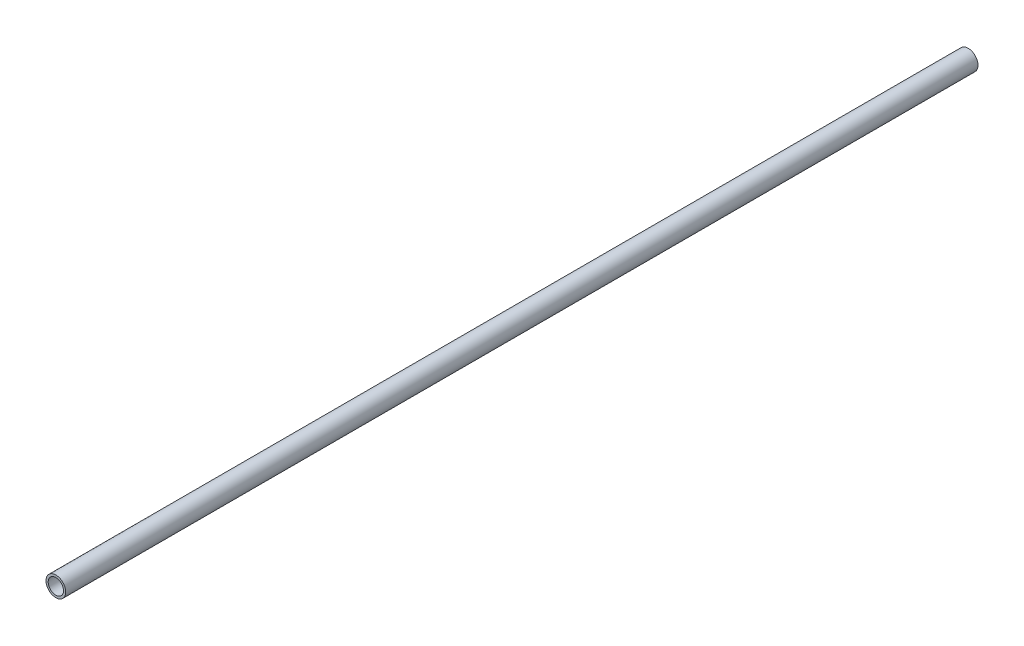
ISO-10303-21;
HEADER;
FILE_DESCRIPTION(('STEP AP214'),'2;1');
FILE_NAME('part.step','',(''),(''),'','','');
FILE_SCHEMA(('AUTOMOTIVE_DESIGN { 1 0 10303 214 1 1 1 1 }'));
ENDSEC;
DATA;
#1=APPLICATION_CONTEXT('core data for automotive mechanical design processes');
#2=APPLICATION_PROTOCOL_DEFINITION('international standard','automotive_design',2000,#1);
#3=PRODUCT_CONTEXT('',#1,'mechanical');
#4=PRODUCT('Part','Part','',(#3));
#5=PRODUCT_RELATED_PRODUCT_CATEGORY('part','',(#4));
#6=PRODUCT_DEFINITION_FORMATION('','',#4);
#7=PRODUCT_DEFINITION_CONTEXT('part definition',#1,'design');
#8=PRODUCT_DEFINITION('design','',#6,#7);
#9=PRODUCT_DEFINITION_SHAPE('','',#8);
#10=(LENGTH_UNIT() NAMED_UNIT(*) SI_UNIT(.MILLI.,.METRE.));
#11=(NAMED_UNIT(*) PLANE_ANGLE_UNIT() SI_UNIT($,.RADIAN.));
#12=(NAMED_UNIT(*) SI_UNIT($,.STERADIAN.) SOLID_ANGLE_UNIT());
#13=UNCERTAINTY_MEASURE_WITH_UNIT(LENGTH_MEASURE(1.E-05),#10,'distance_accuracy_value','');
#14=(GEOMETRIC_REPRESENTATION_CONTEXT(3) GLOBAL_UNCERTAINTY_ASSIGNED_CONTEXT((#13)) GLOBAL_UNIT_ASSIGNED_CONTEXT((#10,
#11,#12)) REPRESENTATION_CONTEXT('',''));
#15=CARTESIAN_POINT('',(0.,0.,0.));
#16=DIRECTION('',(0.,0.,1.));
#17=DIRECTION('',(1.,0.,0.));
#18=AXIS2_PLACEMENT_3D('',#15,#16,#17);
#19=CARTESIAN_POINT('',(-7.31916779058315,4.99702218634191,1270.));
#20=DIRECTION('',(0.,0.,-1.));
#21=DIRECTION('',(-1.,0.,0.));
#22=AXIS2_PLACEMENT_3D('',#19,#20,#21);
#23=CYLINDRICAL_SURFACE('',#22,13.716);
#24=CARTESIAN_POINT('',(-7.31916779058315,4.99702218634191,1270.));
#25=DIRECTION('',(0.,0.,1.));
#26=DIRECTION('',(1.,0.,0.));
#27=AXIS2_PLACEMENT_3D('',#24,#25,#26);
#28=CIRCLE('',#27,13.716);
#29=CARTESIAN_POINT('',(6.39683220941685,4.99702218634191,1270.));
#30=VERTEX_POINT('',#29);
#31=EDGE_CURVE('E10',#30,#30,#28,.T.);
#32=ORIENTED_EDGE('',*,*,#31,.F.);
#33=EDGE_LOOP('',(#32));
#34=FACE_BOUND('',#33,.T.);
#35=CARTESIAN_POINT('',(-7.31916779058315,4.99702218634191,0.));
#36=DIRECTION('',(0.,0.,1.));
#37=DIRECTION('',(1.,0.,0.));
#38=AXIS2_PLACEMENT_3D('',#35,#36,#37);
#39=CIRCLE('',#38,13.716);
#40=CARTESIAN_POINT('',(6.39683220941685,4.99702218634191,0.));
#41=VERTEX_POINT('',#40);
#42=EDGE_CURVE('E38',#41,#41,#39,.T.);
#43=ORIENTED_EDGE('',*,*,#42,.T.);
#44=EDGE_LOOP('',(#43));
#45=FACE_BOUND('',#44,.T.);
#46=ADVANCED_FACE('F35',(#34,#45),#23,.T.);
#47=CARTESIAN_POINT('',(-7.31916779058315,4.99702218634191,1270.));
#48=DIRECTION('',(0.,0.,1.));
#49=DIRECTION('',(1.,0.,0.));
#50=AXIS2_PLACEMENT_3D('',#47,#48,#49);
#51=PLANE('',#50);
#52=CARTESIAN_POINT('',(-7.31916779058315,4.99702218634191,1270.));
#53=DIRECTION('',(0.,0.,-1.));
#54=DIRECTION('',(-1.,0.,0.));
#55=AXIS2_PLACEMENT_3D('',#52,#53,#54);
#56=CIRCLE('',#55,10.668);
#57=CARTESIAN_POINT('',(-17.9871677905831,4.99702218634191,1270.));
#58=VERTEX_POINT('',#57);
#59=EDGE_CURVE('E47',#58,#58,#56,.T.);
#60=ORIENTED_EDGE('',*,*,#59,.T.);
#61=EDGE_LOOP('',(#60));
#62=FACE_BOUND('',#61,.T.);
#63=ORIENTED_EDGE('',*,*,#31,.T.);
#64=EDGE_LOOP('',(#63));
#65=FACE_BOUND('',#64,.T.);
#66=ADVANCED_FACE('F57',(#62,#65),#51,.T.);
#67=CARTESIAN_POINT('',(-7.31916779058315,4.99702218634191,0.));
#68=DIRECTION('',(0.,0.,1.));
#69=DIRECTION('',(1.,0.,0.));
#70=AXIS2_PLACEMENT_3D('',#67,#68,#69);
#71=PLANE('',#70);
#72=CARTESIAN_POINT('',(-7.31916779058315,4.99702218634191,0.));
#73=DIRECTION('',(0.,0.,-1.));
#74=DIRECTION('',(-1.,0.,0.));
#75=AXIS2_PLACEMENT_3D('',#72,#73,#74);
#76=CIRCLE('',#75,10.668);
#77=CARTESIAN_POINT('',(-17.9871677905831,4.99702218634191,0.));
#78=VERTEX_POINT('',#77);
#79=EDGE_CURVE('E49',#78,#78,#76,.T.);
#80=ORIENTED_EDGE('',*,*,#79,.F.);
#81=EDGE_LOOP('',(#80));
#82=FACE_BOUND('',#81,.T.);
#83=ORIENTED_EDGE('',*,*,#42,.F.);
#84=EDGE_LOOP('',(#83));
#85=FACE_BOUND('',#84,.T.);
#86=ADVANCED_FACE('F62',(#82,#85),#71,.F.);
#87=CARTESIAN_POINT('',(-7.31916779058315,4.99702218634191,1270.));
#88=DIRECTION('',(0.,0.,-1.));
#89=DIRECTION('',(-1.,0.,0.));
#90=AXIS2_PLACEMENT_3D('',#87,#88,#89);
#91=CYLINDRICAL_SURFACE('',#90,10.668);
#92=ORIENTED_EDGE('',*,*,#59,.F.);
#93=EDGE_LOOP('',(#92));
#94=FACE_BOUND('',#93,.T.);
#95=ORIENTED_EDGE('',*,*,#79,.T.);
#96=EDGE_LOOP('',(#95));
#97=FACE_BOUND('',#96,.T.);
#98=ADVANCED_FACE('F59',(#94,#97),#91,.F.);
#99=CLOSED_SHELL('',(#46,#66,#86,#98));
#100=MANIFOLD_SOLID_BREP('B2',#99);
#101=ADVANCED_BREP_SHAPE_REPRESENTATION('',(#18,#100),#14);
#102=SHAPE_DEFINITION_REPRESENTATION(#9,#101);
ENDSEC;
END-ISO-10303-21;
